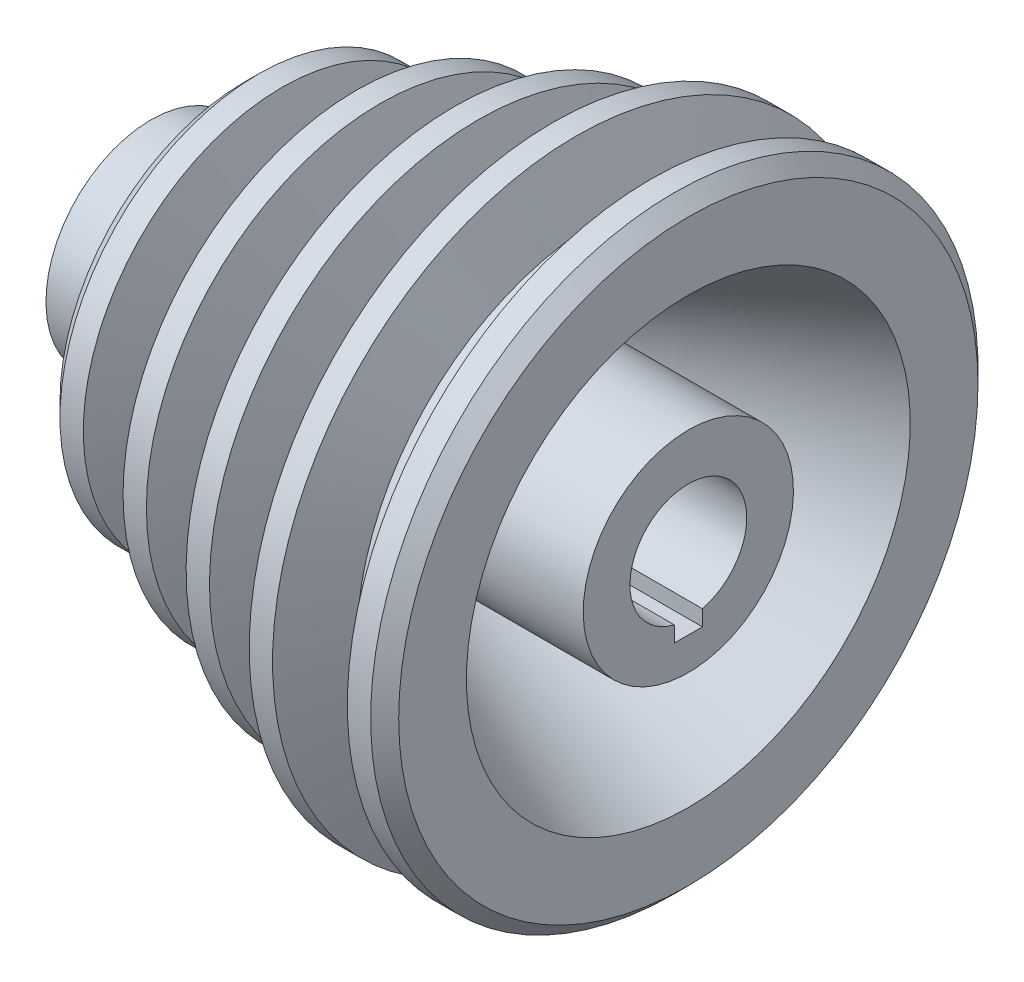
ISO-10303-21;
HEADER;
FILE_DESCRIPTION(('STEP AP214'),'2;1');
FILE_NAME('part.step','',(''),(''),'','','');
FILE_SCHEMA(('AUTOMOTIVE_DESIGN { 1 0 10303 214 1 1 1 1 }'));
ENDSEC;
DATA;
#1=APPLICATION_CONTEXT('core data for automotive mechanical design processes');
#2=APPLICATION_PROTOCOL_DEFINITION('international standard','automotive_design',2000,#1);
#3=PRODUCT_CONTEXT('',#1,'mechanical');
#4=PRODUCT('Part','Part','',(#3));
#5=PRODUCT_RELATED_PRODUCT_CATEGORY('part','',(#4));
#6=PRODUCT_DEFINITION_FORMATION('','',#4);
#7=PRODUCT_DEFINITION_CONTEXT('part definition',#1,'design');
#8=PRODUCT_DEFINITION('design','',#6,#7);
#9=PRODUCT_DEFINITION_SHAPE('','',#8);
#10=(LENGTH_UNIT() NAMED_UNIT(*) SI_UNIT(.MILLI.,.METRE.));
#11=(NAMED_UNIT(*) PLANE_ANGLE_UNIT() SI_UNIT($,.RADIAN.));
#12=(NAMED_UNIT(*) SI_UNIT($,.STERADIAN.) SOLID_ANGLE_UNIT());
#13=UNCERTAINTY_MEASURE_WITH_UNIT(LENGTH_MEASURE(1.E-05),#10,'distance_accuracy_value','');
#14=(GEOMETRIC_REPRESENTATION_CONTEXT(3) GLOBAL_UNCERTAINTY_ASSIGNED_CONTEXT((#13)) GLOBAL_UNIT_ASSIGNED_CONTEXT((#10,
#11,#12)) REPRESENTATION_CONTEXT('',''));
#15=CARTESIAN_POINT('',(0.,0.,0.));
#16=DIRECTION('',(0.,0.,1.));
#17=DIRECTION('',(1.,0.,0.));
#18=AXIS2_PLACEMENT_3D('',#15,#16,#17);
#19=CARTESIAN_POINT('',(57.5,22.5,0.));
#20=DIRECTION('',(1.,0.,0.));
#21=DIRECTION('',(0.,1.,0.));
#22=AXIS2_PLACEMENT_3D('',#19,#20,#21);
#23=PLANE('',#22);
#24=DIRECTION('',(0.,1.,0.));
#25=VECTOR('',#24,1.);
#26=CARTESIAN_POINT('',(57.5,-9.49999999999999,3.));
#27=LINE('',#26,#25);
#28=CARTESIAN_POINT('',(57.5,-15.5,3.));
#29=VERTEX_POINT('',#28);
#30=CARTESIAN_POINT('',(57.5,-12.1346610995116,3.));
#31=VERTEX_POINT('',#30);
#32=EDGE_CURVE('E100',#29,#31,#27,.T.);
#33=ORIENTED_EDGE('',*,*,#32,.T.);
#34=CARTESIAN_POINT('',(57.5,0.,0.));
#35=DIRECTION('',(1.,0.,0.));
#36=DIRECTION('',(0.,1.,0.));
#37=AXIS2_PLACEMENT_3D('',#34,#35,#36);
#38=CIRCLE('',#37,12.5);
#39=CARTESIAN_POINT('',(57.5,-12.1346610995116,-3.));
#40=VERTEX_POINT('',#39);
#41=EDGE_CURVE('E99',#40,#31,#38,.T.);
#42=ORIENTED_EDGE('',*,*,#41,.F.);
#43=DIRECTION('',(0.,-1.,0.));
#44=VECTOR('',#43,1.);
#45=CARTESIAN_POINT('',(57.5,-9.49999999999999,-3.));
#46=LINE('',#45,#44);
#47=CARTESIAN_POINT('',(57.5,-15.5,-3.));
#48=VERTEX_POINT('',#47);
#49=EDGE_CURVE('E85',#40,#48,#46,.T.);
#50=ORIENTED_EDGE('',*,*,#49,.T.);
#51=DIRECTION('',(0.,0.,1.));
#52=VECTOR('',#51,1.);
#53=CARTESIAN_POINT('',(57.5,-15.5,-3.));
#54=LINE('',#53,#52);
#55=EDGE_CURVE('E90',#48,#29,#54,.T.);
#56=ORIENTED_EDGE('',*,*,#55,.T.);
#57=EDGE_LOOP('',(#33,#42,#50,#56));
#58=FACE_BOUND('',#57,.T.);
#59=CARTESIAN_POINT('',(57.5,0.,0.));
#60=DIRECTION('',(1.,0.,0.));
#61=DIRECTION('',(0.,1.,0.));
#62=AXIS2_PLACEMENT_3D('',#59,#60,#61);
#63=CIRCLE('',#62,22.5);
#64=CARTESIAN_POINT('',(57.5,22.5,0.));
#65=VERTEX_POINT('',#64);
#66=EDGE_CURVE('E111',#65,#65,#63,.T.);
#67=ORIENTED_EDGE('',*,*,#66,.T.);
#68=EDGE_LOOP('',(#67));
#69=FACE_BOUND('',#68,.T.);
#70=ADVANCED_FACE('F41',(#58,#69),#23,.T.);
#71=CARTESIAN_POINT('',(57.5,0.,0.));
#72=DIRECTION('',(1.,0.,0.));
#73=DIRECTION('',(0.,1.,0.));
#74=AXIS2_PLACEMENT_3D('',#71,#72,#73);
#75=CYLINDRICAL_SURFACE('',#74,12.5);
#76=DIRECTION('',(1.,0.,0.));
#77=VECTOR('',#76,1.);
#78=CARTESIAN_POINT('',(57.5,-12.1346610995116,3.));
#79=LINE('',#78,#77);
#80=CARTESIAN_POINT('',(-57.5,-12.1346610995116,3.));
#81=VERTEX_POINT('',#80);
#82=EDGE_CURVE('E64',#81,#31,#79,.T.);
#83=ORIENTED_EDGE('',*,*,#82,.F.);
#84=CARTESIAN_POINT('',(-57.5,0.,0.));
#85=DIRECTION('',(1.,0.,0.));
#86=DIRECTION('',(0.,1.,0.));
#87=AXIS2_PLACEMENT_3D('',#84,#85,#86);
#88=CIRCLE('',#87,12.5);
#89=CARTESIAN_POINT('',(-57.5,-12.1346610995116,-3.));
#90=VERTEX_POINT('',#89);
#91=EDGE_CURVE('E177',#90,#81,#88,.T.);
#92=ORIENTED_EDGE('',*,*,#91,.F.);
#93=DIRECTION('',(1.,0.,0.));
#94=VECTOR('',#93,1.);
#95=CARTESIAN_POINT('',(57.5,-12.1346610995116,-3.));
#96=LINE('',#95,#94);
#97=EDGE_CURVE('E56',#40,#90,#96,.F.);
#98=ORIENTED_EDGE('',*,*,#97,.F.);
#99=ORIENTED_EDGE('',*,*,#41,.T.);
#100=EDGE_LOOP('',(#83,#92,#98,#99));
#101=FACE_BOUND('',#100,.T.);
#102=ADVANCED_FACE('F309',(#101),#75,.F.);
#103=CARTESIAN_POINT('',(-57.5,12.5,0.));
#104=DIRECTION('',(-1.,0.,0.));
#105=DIRECTION('',(0.,-1.,0.));
#106=AXIS2_PLACEMENT_3D('',#103,#104,#105);
#107=PLANE('',#106);
#108=DIRECTION('',(0.,1.,0.));
#109=VECTOR('',#108,1.);
#110=CARTESIAN_POINT('',(-57.5,-9.50000000000001,3.));
#111=LINE('',#110,#109);
#112=CARTESIAN_POINT('',(-57.5,-15.5,3.));
#113=VERTEX_POINT('',#112);
#114=EDGE_CURVE('E105',#113,#81,#111,.T.);
#115=ORIENTED_EDGE('',*,*,#114,.F.);
#116=DIRECTION('',(0.,0.,1.));
#117=VECTOR('',#116,1.);
#118=CARTESIAN_POINT('',(-57.5,-15.5,-3.));
#119=LINE('',#118,#117);
#120=CARTESIAN_POINT('',(-57.5,-15.5,-3.));
#121=VERTEX_POINT('',#120);
#122=EDGE_CURVE('E102',#121,#113,#119,.T.);
#123=ORIENTED_EDGE('',*,*,#122,.F.);
#124=DIRECTION('',(0.,-1.,0.));
#125=VECTOR('',#124,1.);
#126=CARTESIAN_POINT('',(-57.5,12.5,-2.99999999999999));
#127=LINE('',#126,#125);
#128=EDGE_CURVE('E11',#90,#121,#127,.T.);
#129=ORIENTED_EDGE('',*,*,#128,.F.);
#130=ORIENTED_EDGE('',*,*,#91,.T.);
#131=EDGE_LOOP('',(#115,#123,#129,#130));
#132=FACE_BOUND('',#131,.T.);
#133=CARTESIAN_POINT('',(-57.5,0.,0.));
#134=DIRECTION('',(1.,0.,0.));
#135=DIRECTION('',(0.,1.,0.));
#136=AXIS2_PLACEMENT_3D('',#133,#134,#135);
#137=CIRCLE('',#136,22.5);
#138=CARTESIAN_POINT('',(-57.5,22.5,0.));
#139=VERTEX_POINT('',#138);
#140=EDGE_CURVE('E174',#139,#139,#137,.T.);
#141=ORIENTED_EDGE('',*,*,#140,.F.);
#142=EDGE_LOOP('',(#141));
#143=FACE_BOUND('',#142,.T.);
#144=ADVANCED_FACE('F314',(#132,#143),#107,.T.);
#145=CARTESIAN_POINT('',(57.5,0.,0.));
#146=DIRECTION('',(1.,0.,0.));
#147=DIRECTION('',(0.,1.,0.));
#148=AXIS2_PLACEMENT_3D('',#145,#146,#147);
#149=CYLINDRICAL_SURFACE('',#148,22.5);
#150=ORIENTED_EDGE('',*,*,#140,.T.);
#151=EDGE_LOOP('',(#150));
#152=FACE_BOUND('',#151,.T.);
#153=CARTESIAN_POINT('',(-37.5,0.,0.));
#154=DIRECTION('',(1.,0.,0.));
#155=DIRECTION('',(0.,1.,0.));
#156=AXIS2_PLACEMENT_3D('',#153,#154,#155);
#157=CIRCLE('',#156,22.5);
#158=CARTESIAN_POINT('',(-37.5,22.5,0.));
#159=VERTEX_POINT('',#158);
#160=EDGE_CURVE('E171',#159,#159,#157,.T.);
#161=ORIENTED_EDGE('',*,*,#160,.F.);
#162=EDGE_LOOP('',(#161));
#163=FACE_BOUND('',#162,.T.);
#164=ADVANCED_FACE('F493',(#152,#163),#149,.T.);
#165=CARTESIAN_POINT('',(-37.5,22.5,0.));
#166=DIRECTION('',(-1.,0.,0.));
#167=DIRECTION('',(0.,-1.,0.));
#168=AXIS2_PLACEMENT_3D('',#165,#166,#167);
#169=PLANE('',#168);
#170=CARTESIAN_POINT('',(-37.5,0.,0.));
#171=DIRECTION('',(-1.,0.,0.));
#172=DIRECTION('',(0.,-1.,0.));
#173=AXIS2_PLACEMENT_3D('',#170,#171,#172);
#174=CIRCLE('',#173,39.5);
#175=CARTESIAN_POINT('',(-37.5,-39.5,0.));
#176=VERTEX_POINT('',#175);
#177=EDGE_CURVE('E50',#176,#176,#174,.T.);
#178=ORIENTED_EDGE('',*,*,#177,.T.);
#179=EDGE_LOOP('',(#178));
#180=FACE_BOUND('',#179,.T.);
#181=ORIENTED_EDGE('',*,*,#160,.T.);
#182=EDGE_LOOP('',(#181));
#183=FACE_BOUND('',#182,.T.);
#184=ADVANCED_FACE('F192',(#180,#183),#169,.T.);
#185=CARTESIAN_POINT('',(57.5,0.,0.));
#186=DIRECTION('',(1.,0.,0.));
#187=DIRECTION('',(0.,1.,0.));
#188=AXIS2_PLACEMENT_3D('',#185,#186,#187);
#189=CYLINDRICAL_SURFACE('',#188,42.5);
#190=CARTESIAN_POINT('',(-34.5,0.,0.));
#191=DIRECTION('',(-1.,0.,0.));
#192=DIRECTION('',(0.,-1.,0.));
#193=AXIS2_PLACEMENT_3D('',#190,#191,#192);
#194=CIRCLE('',#193,42.5);
#195=CARTESIAN_POINT('',(-34.5,-42.5,0.));
#196=VERTEX_POINT('',#195);
#197=EDGE_CURVE('E187',#196,#196,#194,.F.);
#198=ORIENTED_EDGE('',*,*,#197,.T.);
#199=EDGE_LOOP('',(#198));
#200=FACE_BOUND('',#199,.T.);
#201=CARTESIAN_POINT('',(-29.5,0.,0.));
#202=DIRECTION('',(1.,0.,0.));
#203=DIRECTION('',(0.,1.,0.));
#204=AXIS2_PLACEMENT_3D('',#201,#202,#203);
#205=CIRCLE('',#204,42.5);
#206=CARTESIAN_POINT('',(-29.5,42.5,0.));
#207=VERTEX_POINT('',#206);
#208=EDGE_CURVE('E168',#207,#207,#205,.T.);
#209=ORIENTED_EDGE('',*,*,#208,.F.);
#210=EDGE_LOOP('',(#209));
#211=FACE_BOUND('',#210,.T.);
#212=ADVANCED_FACE('F201',(#200,#211),#189,.T.);
#213=CARTESIAN_POINT('',(-24.,0.,0.));
#214=DIRECTION('',(-1.,0.,0.));
#215=DIRECTION('',(0.,-1.,0.));
#216=AXIS2_PLACEMENT_3D('',#213,#214,#215);
#217=CONICAL_SURFACE('',#216,27.5,1.21935153279135);
#218=ORIENTED_EDGE('',*,*,#208,.T.);
#219=EDGE_LOOP('',(#218));
#220=FACE_BOUND('',#219,.T.);
#221=CARTESIAN_POINT('',(-24.,0.,0.));
#222=DIRECTION('',(1.,0.,0.));
#223=DIRECTION('',(0.,1.,0.));
#224=AXIS2_PLACEMENT_3D('',#221,#222,#223);
#225=CIRCLE('',#224,27.5);
#226=CARTESIAN_POINT('',(-24.,27.5,0.));
#227=VERTEX_POINT('',#226);
#228=EDGE_CURVE('E165',#227,#227,#225,.T.);
#229=ORIENTED_EDGE('',*,*,#228,.F.);
#230=EDGE_LOOP('',(#229));
#231=FACE_BOUND('',#230,.T.);
#232=ADVANCED_FACE('F204',(#220,#231),#217,.T.);
#233=CARTESIAN_POINT('',(57.5,0.,0.));
#234=DIRECTION('',(1.,0.,0.));
#235=DIRECTION('',(0.,1.,0.));
#236=AXIS2_PLACEMENT_3D('',#233,#234,#235);
#237=CYLINDRICAL_SURFACE('',#236,27.5);
#238=ORIENTED_EDGE('',*,*,#228,.T.);
#239=EDGE_LOOP('',(#238));
#240=FACE_BOUND('',#239,.T.);
#241=CARTESIAN_POINT('',(-19.,0.,0.));
#242=DIRECTION('',(1.,0.,0.));
#243=DIRECTION('',(0.,1.,0.));
#244=AXIS2_PLACEMENT_3D('',#241,#242,#243);
#245=CIRCLE('',#244,27.5);
#246=CARTESIAN_POINT('',(-19.,27.5,0.));
#247=VERTEX_POINT('',#246);
#248=EDGE_CURVE('E162',#247,#247,#245,.T.);
#249=ORIENTED_EDGE('',*,*,#248,.F.);
#250=EDGE_LOOP('',(#249));
#251=FACE_BOUND('',#250,.T.);
#252=ADVANCED_FACE('F210',(#240,#251),#237,.T.);
#253=CARTESIAN_POINT('',(-13.5,0.,0.));
#254=DIRECTION('',(1.,0.,0.));
#255=DIRECTION('',(0.,1.,0.));
#256=AXIS2_PLACEMENT_3D('',#253,#254,#255);
#257=CONICAL_SURFACE('',#256,50.,1.33105321792444);
#258=ORIENTED_EDGE('',*,*,#248,.T.);
#259=EDGE_LOOP('',(#258));
#260=FACE_BOUND('',#259,.T.);
#261=CARTESIAN_POINT('',(-13.5,0.,0.));
#262=DIRECTION('',(1.,0.,0.));
#263=DIRECTION('',(0.,1.,0.));
#264=AXIS2_PLACEMENT_3D('',#261,#262,#263);
#265=CIRCLE('',#264,50.);
#266=CARTESIAN_POINT('',(-13.5,50.,0.));
#267=VERTEX_POINT('',#266);
#268=EDGE_CURVE('E159',#267,#267,#265,.T.);
#269=ORIENTED_EDGE('',*,*,#268,.F.);
#270=EDGE_LOOP('',(#269));
#271=FACE_BOUND('',#270,.T.);
#272=ADVANCED_FACE('F216',(#260,#271),#257,.T.);
#273=CARTESIAN_POINT('',(57.5,0.,0.));
#274=DIRECTION('',(1.,0.,0.));
#275=DIRECTION('',(0.,1.,0.));
#276=AXIS2_PLACEMENT_3D('',#273,#274,#275);
#277=CYLINDRICAL_SURFACE('',#276,50.);
#278=ORIENTED_EDGE('',*,*,#268,.T.);
#279=EDGE_LOOP('',(#278));
#280=FACE_BOUND('',#279,.T.);
#281=CARTESIAN_POINT('',(-8.5,0.,0.));
#282=DIRECTION('',(1.,0.,0.));
#283=DIRECTION('',(0.,1.,0.));
#284=AXIS2_PLACEMENT_3D('',#281,#282,#283);
#285=CIRCLE('',#284,50.);
#286=CARTESIAN_POINT('',(-8.50000000000001,50.,0.));
#287=VERTEX_POINT('',#286);
#288=EDGE_CURVE('E156',#287,#287,#285,.T.);
#289=ORIENTED_EDGE('',*,*,#288,.F.);
#290=EDGE_LOOP('',(#289));
#291=FACE_BOUND('',#290,.T.);
#292=ADVANCED_FACE('F222',(#280,#291),#277,.T.);
#293=CARTESIAN_POINT('',(-3.,0.,0.));
#294=DIRECTION('',(-1.,0.,0.));
#295=DIRECTION('',(0.,-1.,0.));
#296=AXIS2_PLACEMENT_3D('',#293,#294,#295);
#297=CONICAL_SURFACE('',#296,35.,1.21935153279135);
#298=ORIENTED_EDGE('',*,*,#288,.T.);
#299=EDGE_LOOP('',(#298));
#300=FACE_BOUND('',#299,.T.);
#301=CARTESIAN_POINT('',(-3.,0.,0.));
#302=DIRECTION('',(1.,0.,0.));
#303=DIRECTION('',(0.,1.,0.));
#304=AXIS2_PLACEMENT_3D('',#301,#302,#303);
#305=CIRCLE('',#304,35.);
#306=CARTESIAN_POINT('',(-3.00000000000001,35.,0.));
#307=VERTEX_POINT('',#306);
#308=EDGE_CURVE('E153',#307,#307,#305,.T.);
#309=ORIENTED_EDGE('',*,*,#308,.F.);
#310=EDGE_LOOP('',(#309));
#311=FACE_BOUND('',#310,.T.);
#312=ADVANCED_FACE('F228',(#300,#311),#297,.T.);
#313=CARTESIAN_POINT('',(57.5,0.,0.));
#314=DIRECTION('',(1.,0.,0.));
#315=DIRECTION('',(0.,1.,0.));
#316=AXIS2_PLACEMENT_3D('',#313,#314,#315);
#317=CYLINDRICAL_SURFACE('',#316,35.);
#318=ORIENTED_EDGE('',*,*,#308,.T.);
#319=EDGE_LOOP('',(#318));
#320=FACE_BOUND('',#319,.T.);
#321=CARTESIAN_POINT('',(1.99999999999999,0.,0.));
#322=DIRECTION('',(1.,0.,0.));
#323=DIRECTION('',(0.,1.,0.));
#324=AXIS2_PLACEMENT_3D('',#321,#322,#323);
#325=CIRCLE('',#324,35.);
#326=CARTESIAN_POINT('',(1.99999999999999,35.,0.));
#327=VERTEX_POINT('',#326);
#328=EDGE_CURVE('E150',#327,#327,#325,.T.);
#329=ORIENTED_EDGE('',*,*,#328,.F.);
#330=EDGE_LOOP('',(#329));
#331=FACE_BOUND('',#330,.T.);
#332=ADVANCED_FACE('F234',(#320,#331),#317,.T.);
#333=CARTESIAN_POINT('',(7.5,0.,0.));
#334=DIRECTION('',(1.,0.,0.));
#335=DIRECTION('',(0.,1.,0.));
#336=AXIS2_PLACEMENT_3D('',#333,#334,#335);
#337=CONICAL_SURFACE('',#336,57.5,1.33105321792444);
#338=ORIENTED_EDGE('',*,*,#328,.T.);
#339=EDGE_LOOP('',(#338));
#340=FACE_BOUND('',#339,.T.);
#341=CARTESIAN_POINT('',(7.5,0.,0.));
#342=DIRECTION('',(1.,0.,0.));
#343=DIRECTION('',(0.,1.,0.));
#344=AXIS2_PLACEMENT_3D('',#341,#342,#343);
#345=CIRCLE('',#344,57.5);
#346=CARTESIAN_POINT('',(7.49999999999999,57.5,0.));
#347=VERTEX_POINT('',#346);
#348=EDGE_CURVE('E147',#347,#347,#345,.T.);
#349=ORIENTED_EDGE('',*,*,#348,.F.);
#350=EDGE_LOOP('',(#349));
#351=FACE_BOUND('',#350,.T.);
#352=ADVANCED_FACE('F240',(#340,#351),#337,.T.);
#353=CARTESIAN_POINT('',(57.5,0.,0.));
#354=DIRECTION('',(1.,0.,0.));
#355=DIRECTION('',(0.,1.,0.));
#356=AXIS2_PLACEMENT_3D('',#353,#354,#355);
#357=CYLINDRICAL_SURFACE('',#356,57.5);
#358=ORIENTED_EDGE('',*,*,#348,.T.);
#359=EDGE_LOOP('',(#358));
#360=FACE_BOUND('',#359,.T.);
#361=CARTESIAN_POINT('',(12.5,0.,0.));
#362=DIRECTION('',(1.,0.,0.));
#363=DIRECTION('',(0.,1.,0.));
#364=AXIS2_PLACEMENT_3D('',#361,#362,#363);
#365=CIRCLE('',#364,57.5);
#366=CARTESIAN_POINT('',(12.5,57.5,0.));
#367=VERTEX_POINT('',#366);
#368=EDGE_CURVE('E144',#367,#367,#365,.T.);
#369=ORIENTED_EDGE('',*,*,#368,.F.);
#370=EDGE_LOOP('',(#369));
#371=FACE_BOUND('',#370,.T.);
#372=ADVANCED_FACE('F246',(#360,#371),#357,.T.);
#373=CARTESIAN_POINT('',(18.,0.,0.));
#374=DIRECTION('',(-1.,0.,0.));
#375=DIRECTION('',(0.,-1.,0.));
#376=AXIS2_PLACEMENT_3D('',#373,#374,#375);
#377=CONICAL_SURFACE('',#376,42.5,1.21935153279134);
#378=ORIENTED_EDGE('',*,*,#368,.T.);
#379=EDGE_LOOP('',(#378));
#380=FACE_BOUND('',#379,.T.);
#381=CARTESIAN_POINT('',(18.,0.,0.));
#382=DIRECTION('',(1.,0.,0.));
#383=DIRECTION('',(0.,1.,0.));
#384=AXIS2_PLACEMENT_3D('',#381,#382,#383);
#385=CIRCLE('',#384,42.5);
#386=CARTESIAN_POINT('',(18.,42.5,0.));
#387=VERTEX_POINT('',#386);
#388=EDGE_CURVE('E141',#387,#387,#385,.T.);
#389=ORIENTED_EDGE('',*,*,#388,.F.);
#390=EDGE_LOOP('',(#389));
#391=FACE_BOUND('',#390,.T.);
#392=ADVANCED_FACE('F252',(#380,#391),#377,.T.);
#393=CARTESIAN_POINT('',(57.5,0.,0.));
#394=DIRECTION('',(1.,0.,0.));
#395=DIRECTION('',(0.,1.,0.));
#396=AXIS2_PLACEMENT_3D('',#393,#394,#395);
#397=CYLINDRICAL_SURFACE('',#396,42.5);
#398=ORIENTED_EDGE('',*,*,#388,.T.);
#399=EDGE_LOOP('',(#398));
#400=FACE_BOUND('',#399,.T.);
#401=CARTESIAN_POINT('',(23.,0.,0.));
#402=DIRECTION('',(1.,0.,0.));
#403=DIRECTION('',(0.,1.,0.));
#404=AXIS2_PLACEMENT_3D('',#401,#402,#403);
#405=CIRCLE('',#404,42.5);
#406=CARTESIAN_POINT('',(23.,42.5,0.));
#407=VERTEX_POINT('',#406);
#408=EDGE_CURVE('E138',#407,#407,#405,.T.);
#409=ORIENTED_EDGE('',*,*,#408,.F.);
#410=EDGE_LOOP('',(#409));
#411=FACE_BOUND('',#410,.T.);
#412=ADVANCED_FACE('F258',(#400,#411),#397,.T.);
#413=CARTESIAN_POINT('',(28.5,0.,0.));
#414=DIRECTION('',(1.,0.,0.));
#415=DIRECTION('',(0.,1.,0.));
#416=AXIS2_PLACEMENT_3D('',#413,#414,#415);
#417=CONICAL_SURFACE('',#416,65.,1.33105321792444);
#418=ORIENTED_EDGE('',*,*,#408,.T.);
#419=EDGE_LOOP('',(#418));
#420=FACE_BOUND('',#419,.T.);
#421=CARTESIAN_POINT('',(28.5,0.,0.));
#422=DIRECTION('',(1.,0.,0.));
#423=DIRECTION('',(0.,1.,0.));
#424=AXIS2_PLACEMENT_3D('',#421,#422,#423);
#425=CIRCLE('',#424,65.);
#426=CARTESIAN_POINT('',(28.5,65.,0.));
#427=VERTEX_POINT('',#426);
#428=EDGE_CURVE('E135',#427,#427,#425,.T.);
#429=ORIENTED_EDGE('',*,*,#428,.F.);
#430=EDGE_LOOP('',(#429));
#431=FACE_BOUND('',#430,.T.);
#432=ADVANCED_FACE('F264',(#420,#431),#417,.T.);
#433=CARTESIAN_POINT('',(57.5,0.,0.));
#434=DIRECTION('',(1.,0.,0.));
#435=DIRECTION('',(0.,1.,0.));
#436=AXIS2_PLACEMENT_3D('',#433,#434,#435);
#437=CYLINDRICAL_SURFACE('',#436,65.);
#438=ORIENTED_EDGE('',*,*,#428,.T.);
#439=EDGE_LOOP('',(#438));
#440=FACE_BOUND('',#439,.T.);
#441=CARTESIAN_POINT('',(33.5,0.,0.));
#442=DIRECTION('',(1.,0.,0.));
#443=DIRECTION('',(0.,1.,0.));
#444=AXIS2_PLACEMENT_3D('',#441,#442,#443);
#445=CIRCLE('',#444,65.);
#446=CARTESIAN_POINT('',(33.5,65.,0.));
#447=VERTEX_POINT('',#446);
#448=EDGE_CURVE('E132',#447,#447,#445,.T.);
#449=ORIENTED_EDGE('',*,*,#448,.F.);
#450=EDGE_LOOP('',(#449));
#451=FACE_BOUND('',#450,.T.);
#452=ADVANCED_FACE('F270',(#440,#451),#437,.T.);
#453=CARTESIAN_POINT('',(39.,0.,0.));
#454=DIRECTION('',(-1.,0.,0.));
#455=DIRECTION('',(0.,-1.,0.));
#456=AXIS2_PLACEMENT_3D('',#453,#454,#455);
#457=CONICAL_SURFACE('',#456,52.5,1.15628945221011);
#458=ORIENTED_EDGE('',*,*,#448,.T.);
#459=EDGE_LOOP('',(#458));
#460=FACE_BOUND('',#459,.T.);
#461=CARTESIAN_POINT('',(39.,0.,0.));
#462=DIRECTION('',(1.,0.,0.));
#463=DIRECTION('',(0.,1.,0.));
#464=AXIS2_PLACEMENT_3D('',#461,#462,#463);
#465=CIRCLE('',#464,52.5);
#466=CARTESIAN_POINT('',(39.,52.5,0.));
#467=VERTEX_POINT('',#466);
#468=EDGE_CURVE('E129',#467,#467,#465,.T.);
#469=ORIENTED_EDGE('',*,*,#468,.F.);
#470=EDGE_LOOP('',(#469));
#471=FACE_BOUND('',#470,.T.);
#472=ADVANCED_FACE('F276',(#460,#471),#457,.T.);
#473=CARTESIAN_POINT('',(57.5,0.,0.));
#474=DIRECTION('',(1.,0.,0.));
#475=DIRECTION('',(0.,1.,0.));
#476=AXIS2_PLACEMENT_3D('',#473,#474,#475);
#477=CYLINDRICAL_SURFACE('',#476,52.5);
#478=ORIENTED_EDGE('',*,*,#468,.T.);
#479=EDGE_LOOP('',(#478));
#480=FACE_BOUND('',#479,.T.);
#481=CARTESIAN_POINT('',(44.,0.,0.));
#482=DIRECTION('',(1.,0.,0.));
#483=DIRECTION('',(0.,1.,0.));
#484=AXIS2_PLACEMENT_3D('',#481,#482,#483);
#485=CIRCLE('',#484,52.5);
#486=CARTESIAN_POINT('',(44.,52.5,0.));
#487=VERTEX_POINT('',#486);
#488=EDGE_CURVE('E126',#487,#487,#485,.T.);
#489=ORIENTED_EDGE('',*,*,#488,.F.);
#490=EDGE_LOOP('',(#489));
#491=FACE_BOUND('',#490,.T.);
#492=ADVANCED_FACE('F282',(#480,#491),#477,.T.);
#493=CARTESIAN_POINT('',(49.5,0.,0.));
#494=DIRECTION('',(1.,0.,0.));
#495=DIRECTION('',(0.,1.,0.));
#496=AXIS2_PLACEMENT_3D('',#493,#494,#495);
#497=CONICAL_SURFACE('',#496,65.,1.15628945221011);
#498=ORIENTED_EDGE('',*,*,#488,.T.);
#499=EDGE_LOOP('',(#498));
#500=FACE_BOUND('',#499,.T.);
#501=CARTESIAN_POINT('',(49.5,0.,0.));
#502=DIRECTION('',(1.,0.,0.));
#503=DIRECTION('',(0.,1.,0.));
#504=AXIS2_PLACEMENT_3D('',#501,#502,#503);
#505=CIRCLE('',#504,65.);
#506=CARTESIAN_POINT('',(49.5,65.,0.));
#507=VERTEX_POINT('',#506);
#508=EDGE_CURVE('E123',#507,#507,#505,.T.);
#509=ORIENTED_EDGE('',*,*,#508,.F.);
#510=EDGE_LOOP('',(#509));
#511=FACE_BOUND('',#510,.T.);
#512=ADVANCED_FACE('F288',(#500,#511),#497,.T.);
#513=CARTESIAN_POINT('',(57.5,0.,0.));
#514=DIRECTION('',(1.,0.,0.));
#515=DIRECTION('',(0.,1.,0.));
#516=AXIS2_PLACEMENT_3D('',#513,#514,#515);
#517=CYLINDRICAL_SURFACE('',#516,65.);
#518=CARTESIAN_POINT('',(54.5,0.,0.));
#519=DIRECTION('',(1.,0.,0.));
#520=DIRECTION('',(0.,1.,0.));
#521=AXIS2_PLACEMENT_3D('',#518,#519,#520);
#522=CIRCLE('',#521,65.);
#523=CARTESIAN_POINT('',(54.5,65.,0.));
#524=VERTEX_POINT('',#523);
#525=EDGE_CURVE('E184',#524,#524,#522,.F.);
#526=ORIENTED_EDGE('',*,*,#525,.T.);
#527=EDGE_LOOP('',(#526));
#528=FACE_BOUND('',#527,.T.);
#529=ORIENTED_EDGE('',*,*,#508,.T.);
#530=EDGE_LOOP('',(#529));
#531=FACE_BOUND('',#530,.T.);
#532=ADVANCED_FACE('F294',(#528,#531),#517,.T.);
#533=CARTESIAN_POINT('',(57.5,65.,0.));
#534=DIRECTION('',(1.,0.,0.));
#535=DIRECTION('',(0.,1.,0.));
#536=AXIS2_PLACEMENT_3D('',#533,#534,#535);
#537=PLANE('',#536);
#538=CARTESIAN_POINT('',(57.5,0.,0.));
#539=DIRECTION('',(1.,0.,0.));
#540=DIRECTION('',(0.,1.,0.));
#541=AXIS2_PLACEMENT_3D('',#538,#539,#540);
#542=CIRCLE('',#541,62.);
#543=CARTESIAN_POINT('',(57.5,62.,0.));
#544=VERTEX_POINT('',#543);
#545=EDGE_CURVE('E181',#544,#544,#542,.T.);
#546=ORIENTED_EDGE('',*,*,#545,.T.);
#547=EDGE_LOOP('',(#546));
#548=FACE_BOUND('',#547,.T.);
#549=CARTESIAN_POINT('',(57.5,0.,0.));
#550=DIRECTION('',(1.,0.,0.));
#551=DIRECTION('',(0.,1.,0.));
#552=AXIS2_PLACEMENT_3D('',#549,#550,#551);
#553=CIRCLE('',#552,47.5);
#554=CARTESIAN_POINT('',(57.5,47.5,0.));
#555=VERTEX_POINT('',#554);
#556=EDGE_CURVE('E120',#555,#555,#553,.T.);
#557=ORIENTED_EDGE('',*,*,#556,.F.);
#558=EDGE_LOOP('',(#557));
#559=FACE_BOUND('',#558,.T.);
#560=ADVANCED_FACE('F299',(#548,#559),#537,.T.);
#561=CARTESIAN_POINT('',(12.5,0.,0.));
#562=DIRECTION('',(1.,0.,0.));
#563=DIRECTION('',(0.,1.,0.));
#564=AXIS2_PLACEMENT_3D('',#561,#562,#563);
#565=CONICAL_SURFACE('',#564,27.5,0.418224329579229);
#566=ORIENTED_EDGE('',*,*,#556,.T.);
#567=EDGE_LOOP('',(#566));
#568=FACE_BOUND('',#567,.T.);
#569=CARTESIAN_POINT('',(12.5,0.,0.));
#570=DIRECTION('',(1.,0.,0.));
#571=DIRECTION('',(0.,1.,0.));
#572=AXIS2_PLACEMENT_3D('',#569,#570,#571);
#573=CIRCLE('',#572,27.5);
#574=CARTESIAN_POINT('',(12.5,27.5,0.));
#575=VERTEX_POINT('',#574);
#576=EDGE_CURVE('E117',#575,#575,#573,.T.);
#577=ORIENTED_EDGE('',*,*,#576,.F.);
#578=EDGE_LOOP('',(#577));
#579=FACE_BOUND('',#578,.T.);
#580=ADVANCED_FACE('F305',(#568,#579),#565,.F.);
#581=CARTESIAN_POINT('',(12.5,27.5,0.));
#582=DIRECTION('',(1.,0.,0.));
#583=DIRECTION('',(0.,1.,0.));
#584=AXIS2_PLACEMENT_3D('',#581,#582,#583);
#585=PLANE('',#584);
#586=ORIENTED_EDGE('',*,*,#576,.T.);
#587=EDGE_LOOP('',(#586));
#588=FACE_BOUND('',#587,.T.);
#589=CARTESIAN_POINT('',(12.5,0.,0.));
#590=DIRECTION('',(1.,0.,0.));
#591=DIRECTION('',(0.,1.,0.));
#592=AXIS2_PLACEMENT_3D('',#589,#590,#591);
#593=CIRCLE('',#592,22.5);
#594=CARTESIAN_POINT('',(12.5,22.5,0.));
#595=VERTEX_POINT('',#594);
#596=EDGE_CURVE('E114',#595,#595,#593,.T.);
#597=ORIENTED_EDGE('',*,*,#596,.F.);
#598=EDGE_LOOP('',(#597));
#599=FACE_BOUND('',#598,.T.);
#600=ADVANCED_FACE('F327',(#588,#599),#585,.T.);
#601=CARTESIAN_POINT('',(57.5,0.,0.));
#602=DIRECTION('',(1.,0.,0.));
#603=DIRECTION('',(0.,1.,0.));
#604=AXIS2_PLACEMENT_3D('',#601,#602,#603);
#605=CYLINDRICAL_SURFACE('',#604,22.5);
#606=ORIENTED_EDGE('',*,*,#596,.T.);
#607=EDGE_LOOP('',(#606));
#608=FACE_BOUND('',#607,.T.);
#609=ORIENTED_EDGE('',*,*,#66,.F.);
#610=EDGE_LOOP('',(#609));
#611=FACE_BOUND('',#610,.T.);
#612=ADVANCED_FACE('F322',(#608,#611),#605,.T.);
#613=CARTESIAN_POINT('',(57.5,0.,0.));
#614=DIRECTION('',(-1.,0.,0.));
#615=DIRECTION('',(0.,-1.,0.));
#616=AXIS2_PLACEMENT_3D('',#613,#614,#615);
#617=CONICAL_SURFACE('',#616,62.,0.785398163397453);
#618=ORIENTED_EDGE('',*,*,#525,.F.);
#619=EDGE_LOOP('',(#618));
#620=FACE_BOUND('',#619,.T.);
#621=ORIENTED_EDGE('',*,*,#545,.F.);
#622=EDGE_LOOP('',(#621));
#623=FACE_BOUND('',#622,.T.);
#624=ADVANCED_FACE('F198',(#620,#623),#617,.T.);
#625=CARTESIAN_POINT('',(-34.5,0.,0.));
#626=DIRECTION('',(1.,0.,0.));
#627=DIRECTION('',(0.,1.,0.));
#628=AXIS2_PLACEMENT_3D('',#625,#626,#627);
#629=CONICAL_SURFACE('',#628,42.5,0.785398163397449);
#630=ORIENTED_EDGE('',*,*,#177,.F.);
#631=EDGE_LOOP('',(#630));
#632=FACE_BOUND('',#631,.T.);
#633=ORIENTED_EDGE('',*,*,#197,.F.);
#634=EDGE_LOOP('',(#633));
#635=FACE_BOUND('',#634,.T.);
#636=ADVANCED_FACE('F44',(#632,#635),#629,.T.);
#637=CARTESIAN_POINT('',(57.5,-9.49999999999999,3.));
#638=DIRECTION('',(0.,0.,1.));
#639=DIRECTION('',(0.,-1.,0.));
#640=AXIS2_PLACEMENT_3D('',#637,#638,#639);
#641=PLANE('',#640);
#642=ORIENTED_EDGE('',*,*,#82,.T.);
#643=ORIENTED_EDGE('',*,*,#32,.F.);
#644=DIRECTION('',(-1.,0.,0.));
#645=VECTOR('',#644,1.);
#646=CARTESIAN_POINT('',(57.5,-15.5,3.));
#647=LINE('',#646,#645);
#648=EDGE_CURVE('E89',#29,#113,#647,.T.);
#649=ORIENTED_EDGE('',*,*,#648,.T.);
#650=ORIENTED_EDGE('',*,*,#114,.T.);
#651=EDGE_LOOP('',(#642,#643,#649,#650));
#652=FACE_BOUND('',#651,.T.);
#653=ADVANCED_FACE('F197',(#652),#641,.F.);
#654=CARTESIAN_POINT('',(57.5,-15.5,-3.));
#655=DIRECTION('',(0.,-1.,0.));
#656=DIRECTION('',(0.,0.,-1.));
#657=AXIS2_PLACEMENT_3D('',#654,#655,#656);
#658=PLANE('',#657);
#659=ORIENTED_EDGE('',*,*,#122,.T.);
#660=ORIENTED_EDGE('',*,*,#648,.F.);
#661=ORIENTED_EDGE('',*,*,#55,.F.);
#662=DIRECTION('',(-1.,0.,0.));
#663=VECTOR('',#662,1.);
#664=CARTESIAN_POINT('',(57.5,-15.5,-3.));
#665=LINE('',#664,#663);
#666=EDGE_CURVE('E81',#48,#121,#665,.T.);
#667=ORIENTED_EDGE('',*,*,#666,.T.);
#668=EDGE_LOOP('',(#659,#660,#661,#667));
#669=FACE_BOUND('',#668,.T.);
#670=ADVANCED_FACE('F93',(#669),#658,.F.);
#671=CARTESIAN_POINT('',(57.5,-9.49999999999999,-3.));
#672=DIRECTION('',(0.,0.,-1.));
#673=DIRECTION('',(0.,1.,0.));
#674=AXIS2_PLACEMENT_3D('',#671,#672,#673);
#675=PLANE('',#674);
#676=ORIENTED_EDGE('',*,*,#97,.T.);
#677=ORIENTED_EDGE('',*,*,#128,.T.);
#678=ORIENTED_EDGE('',*,*,#666,.F.);
#679=ORIENTED_EDGE('',*,*,#49,.F.);
#680=EDGE_LOOP('',(#676,#677,#678,#679));
#681=FACE_BOUND('',#680,.T.);
#682=ADVANCED_FACE('F83',(#681),#675,.F.);
#683=CLOSED_SHELL('',(#70,#102,#144,#164,#184,#212,#232,#252,#272,#292,#312,#332,#352,#372,#392,
#412,#432,#452,#472,#492,#512,#532,#560,#580,#600,#612,#624,#636,#653,#670,#682));
#684=MANIFOLD_SOLID_BREP('B2',#683);
#685=ADVANCED_BREP_SHAPE_REPRESENTATION('',(#18,#684),#14);
#686=SHAPE_DEFINITION_REPRESENTATION(#9,#685);
ENDSEC;
END-ISO-10303-21;
